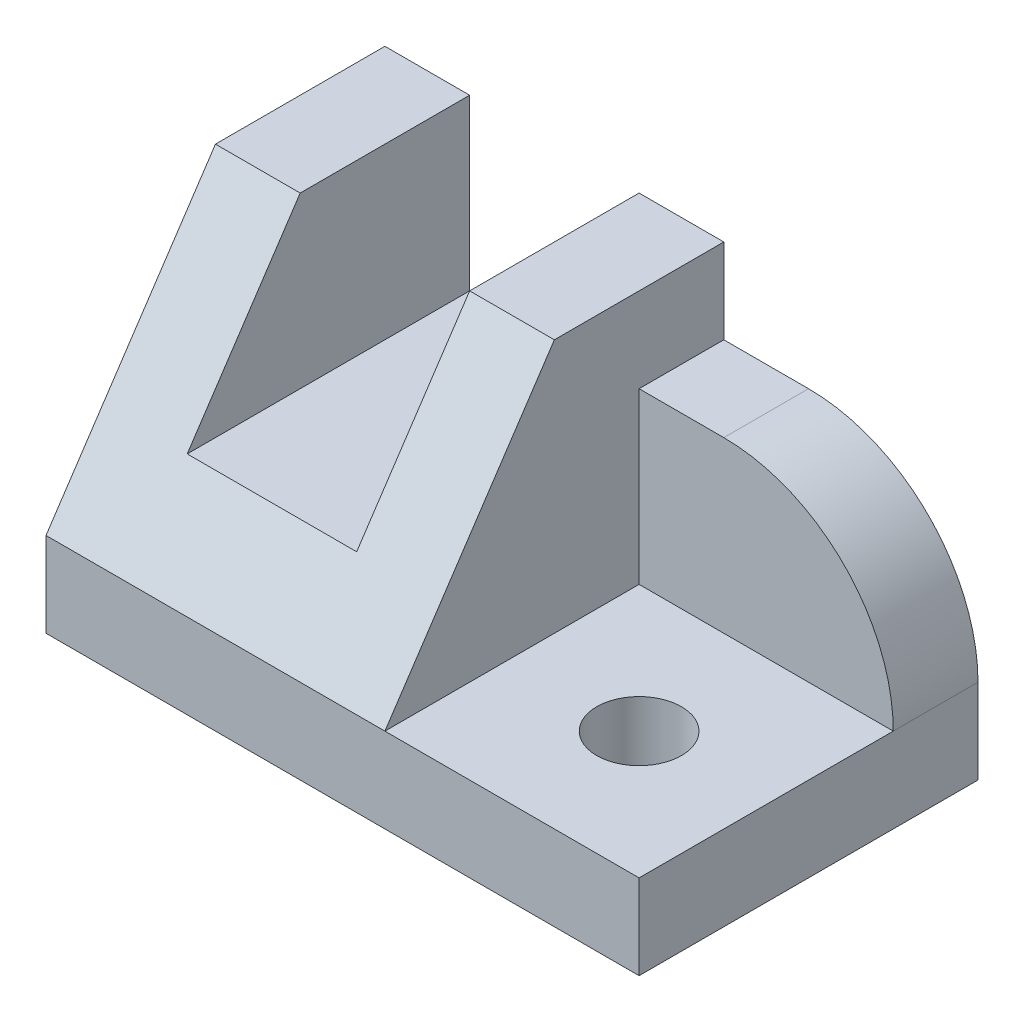
ISO-10303-21;
HEADER;
FILE_DESCRIPTION(('STEP AP214'),'2;1');
FILE_NAME('part.step','',(''),(''),'','','');
FILE_SCHEMA(('AUTOMOTIVE_DESIGN { 1 0 10303 214 1 1 1 1 }'));
ENDSEC;
DATA;
#1=APPLICATION_CONTEXT('core data for automotive mechanical design processes');
#2=APPLICATION_PROTOCOL_DEFINITION('international standard','automotive_design',2000,#1);
#3=PRODUCT_CONTEXT('',#1,'mechanical');
#4=PRODUCT('Part','Part','',(#3));
#5=PRODUCT_RELATED_PRODUCT_CATEGORY('part','',(#4));
#6=PRODUCT_DEFINITION_FORMATION('','',#4);
#7=PRODUCT_DEFINITION_CONTEXT('part definition',#1,'design');
#8=PRODUCT_DEFINITION('design','',#6,#7);
#9=PRODUCT_DEFINITION_SHAPE('','',#8);
#10=(LENGTH_UNIT() NAMED_UNIT(*) SI_UNIT(.MILLI.,.METRE.));
#11=(NAMED_UNIT(*) PLANE_ANGLE_UNIT() SI_UNIT($,.RADIAN.));
#12=(NAMED_UNIT(*) SI_UNIT($,.STERADIAN.) SOLID_ANGLE_UNIT());
#13=UNCERTAINTY_MEASURE_WITH_UNIT(LENGTH_MEASURE(1.E-05),#10,'distance_accuracy_value','');
#14=(GEOMETRIC_REPRESENTATION_CONTEXT(3) GLOBAL_UNCERTAINTY_ASSIGNED_CONTEXT((#13)) GLOBAL_UNIT_ASSIGNED_CONTEXT((#10,
#11,#12)) REPRESENTATION_CONTEXT('',''));
#15=CARTESIAN_POINT('',(0.,0.,0.));
#16=DIRECTION('',(0.,0.,1.));
#17=DIRECTION('',(1.,0.,0.));
#18=AXIS2_PLACEMENT_3D('',#15,#16,#17);
#19=CARTESIAN_POINT('',(0.,20.,0.));
#20=DIRECTION('',(0.,1.,0.));
#21=DIRECTION('',(0.,0.,1.));
#22=AXIS2_PLACEMENT_3D('',#19,#20,#21);
#23=PLANE('',#22);
#24=DIRECTION('',(0.,0.,-1.));
#25=VECTOR('',#24,1.);
#26=CARTESIAN_POINT('',(-2.5,20.,10.));
#27=LINE('',#26,#25);
#28=CARTESIAN_POINT('',(-2.5,20.,0.));
#29=VERTEX_POINT('',#28);
#30=CARTESIAN_POINT('',(-2.5,20.,-10.));
#31=VERTEX_POINT('',#30);
#32=EDGE_CURVE('E150',#29,#31,#27,.T.);
#33=ORIENTED_EDGE('',*,*,#32,.F.);
#34=DIRECTION('',(1.,0.,0.));
#35=VECTOR('',#34,1.);
#36=CARTESIAN_POINT('',(-17.5,20.,0.));
#37=LINE('',#36,#35);
#38=CARTESIAN_POINT('',(2.50000000000001,20.,0.));
#39=VERTEX_POINT('',#38);
#40=EDGE_CURVE('E174',#29,#39,#37,.T.);
#41=ORIENTED_EDGE('',*,*,#40,.T.);
#42=DIRECTION('',(0.,0.,1.));
#43=VECTOR('',#42,1.);
#44=CARTESIAN_POINT('',(2.50000000000001,20.,0.));
#45=LINE('',#44,#43);
#46=CARTESIAN_POINT('',(2.50000000000001,20.,-10.));
#47=VERTEX_POINT('',#46);
#48=EDGE_CURVE('E176',#47,#39,#45,.T.);
#49=ORIENTED_EDGE('',*,*,#48,.F.);
#50=DIRECTION('',(1.,0.,0.));
#51=VECTOR('',#50,1.);
#52=CARTESIAN_POINT('',(0.,20.,-10.));
#53=LINE('',#52,#51);
#54=EDGE_CURVE('E179',#31,#47,#53,.T.);
#55=ORIENTED_EDGE('',*,*,#54,.F.);
#56=EDGE_LOOP('',(#33,#41,#49,#55));
#57=FACE_BOUND('',#56,.T.);
#58=ADVANCED_FACE('F39',(#57),#23,.T.);
#59=CARTESIAN_POINT('',(0.,5.,10.));
#60=DIRECTION('',(0.,0.,-1.));
#61=DIRECTION('',(-1.,0.,0.));
#62=AXIS2_PLACEMENT_3D('',#59,#60,#61);
#63=PLANE('',#62);
#64=DIRECTION('',(1.,0.,0.));
#65=VECTOR('',#64,1.);
#66=CARTESIAN_POINT('',(0.,5.,10.));
#67=LINE('',#66,#65);
#68=CARTESIAN_POINT('',(2.50000000000001,5.,10.));
#69=VERTEX_POINT('',#68);
#70=CARTESIAN_POINT('',(17.5,5.,10.));
#71=VERTEX_POINT('',#70);
#72=EDGE_CURVE('E221',#69,#71,#67,.T.);
#73=ORIENTED_EDGE('',*,*,#72,.F.);
#74=DIRECTION('',(1.,0.,0.));
#75=VECTOR('',#74,1.);
#76=CARTESIAN_POINT('',(-17.5,5.,10.));
#77=LINE('',#76,#75);
#78=CARTESIAN_POINT('',(-17.5,5.,10.));
#79=VERTEX_POINT('',#78);
#80=EDGE_CURVE('E167',#79,#69,#77,.T.);
#81=ORIENTED_EDGE('',*,*,#80,.F.);
#82=DIRECTION('',(0.,-1.,0.));
#83=VECTOR('',#82,1.);
#84=CARTESIAN_POINT('',(-17.5,20.,10.));
#85=LINE('',#84,#83);
#86=CARTESIAN_POINT('',(-17.5,0.,10.));
#87=VERTEX_POINT('',#86);
#88=EDGE_CURVE('E184',#79,#87,#85,.T.);
#89=ORIENTED_EDGE('',*,*,#88,.T.);
#90=DIRECTION('',(1.,0.,0.));
#91=VECTOR('',#90,1.);
#92=CARTESIAN_POINT('',(0.,0.,10.));
#93=LINE('',#92,#91);
#94=CARTESIAN_POINT('',(17.5,0.,10.));
#95=VERTEX_POINT('',#94);
#96=EDGE_CURVE('E230',#87,#95,#93,.T.);
#97=ORIENTED_EDGE('',*,*,#96,.T.);
#98=DIRECTION('',(0.,-1.,0.));
#99=VECTOR('',#98,1.);
#100=CARTESIAN_POINT('',(17.5,5.,10.));
#101=LINE('',#100,#99);
#102=EDGE_CURVE('E227',#71,#95,#101,.T.);
#103=ORIENTED_EDGE('',*,*,#102,.F.);
#104=EDGE_LOOP('',(#73,#81,#89,#97,#103));
#105=FACE_BOUND('',#104,.T.);
#106=ADVANCED_FACE('F270',(#105),#63,.F.);
#107=CARTESIAN_POINT('',(10.,5.,2.5));
#108=DIRECTION('',(0.,-1.,0.));
#109=DIRECTION('',(0.,0.,-1.));
#110=AXIS2_PLACEMENT_3D('',#107,#108,#109);
#111=CYLINDRICAL_SURFACE('',#110,2.5);
#112=CARTESIAN_POINT('',(10.,5.,2.5));
#113=DIRECTION('',(0.,1.,0.));
#114=DIRECTION('',(0.,0.,1.));
#115=AXIS2_PLACEMENT_3D('',#112,#113,#114);
#116=CIRCLE('',#115,2.5);
#117=CARTESIAN_POINT('',(10.,5.,5.));
#118=VERTEX_POINT('',#117);
#119=EDGE_CURVE('E211',#118,#118,#116,.T.);
#120=ORIENTED_EDGE('',*,*,#119,.T.);
#121=EDGE_LOOP('',(#120));
#122=FACE_BOUND('',#121,.T.);
#123=CARTESIAN_POINT('',(10.,0.,2.5));
#124=DIRECTION('',(0.,1.,0.));
#125=DIRECTION('',(0.,0.,1.));
#126=AXIS2_PLACEMENT_3D('',#123,#124,#125);
#127=CIRCLE('',#126,2.5);
#128=CARTESIAN_POINT('',(10.,0.,5.));
#129=VERTEX_POINT('',#128);
#130=EDGE_CURVE('E210',#129,#129,#127,.T.);
#131=ORIENTED_EDGE('',*,*,#130,.F.);
#132=EDGE_LOOP('',(#131));
#133=FACE_BOUND('',#132,.T.);
#134=ADVANCED_FACE('F299',(#122,#133),#111,.F.);
#135=CARTESIAN_POINT('',(17.5,5.,0.));
#136=DIRECTION('',(-1.,0.,0.));
#137=DIRECTION('',(0.,0.,1.));
#138=AXIS2_PLACEMENT_3D('',#135,#136,#137);
#139=PLANE('',#138);
#140=DIRECTION('',(0.,-1.,0.));
#141=VECTOR('',#140,1.);
#142=CARTESIAN_POINT('',(17.5,15.,-10.));
#143=LINE('',#142,#141);
#144=CARTESIAN_POINT('',(17.5,5.,-10.));
#145=VERTEX_POINT('',#144);
#146=CARTESIAN_POINT('',(17.5,0.,-10.));
#147=VERTEX_POINT('',#146);
#148=EDGE_CURVE('E203',#145,#147,#143,.T.);
#149=ORIENTED_EDGE('',*,*,#148,.F.);
#150=DIRECTION('',(0.,0.,-1.));
#151=VECTOR('',#150,1.);
#152=CARTESIAN_POINT('',(17.5,5.,-5.));
#153=LINE('',#152,#151);
#154=CARTESIAN_POINT('',(17.5,5.,-5.));
#155=VERTEX_POINT('',#154);
#156=EDGE_CURVE('E47',#145,#155,#153,.F.);
#157=ORIENTED_EDGE('',*,*,#156,.T.);
#158=DIRECTION('',(0.,0.,-1.));
#159=VECTOR('',#158,1.);
#160=CARTESIAN_POINT('',(17.5,5.,0.));
#161=LINE('',#160,#159);
#162=EDGE_CURVE('E224',#71,#155,#161,.T.);
#163=ORIENTED_EDGE('',*,*,#162,.F.);
#164=ORIENTED_EDGE('',*,*,#102,.T.);
#165=DIRECTION('',(0.,0.,-1.));
#166=VECTOR('',#165,1.);
#167=CARTESIAN_POINT('',(17.5,0.,0.));
#168=LINE('',#167,#166);
#169=EDGE_CURVE('E215',#95,#147,#168,.T.);
#170=ORIENTED_EDGE('',*,*,#169,.T.);
#171=EDGE_LOOP('',(#149,#157,#163,#164,#170));
#172=FACE_BOUND('',#171,.T.);
#173=ADVANCED_FACE('F246',(#172),#139,.F.);
#174=CARTESIAN_POINT('',(0.,5.,0.));
#175=DIRECTION('',(0.,1.,0.));
#176=DIRECTION('',(0.,0.,1.));
#177=AXIS2_PLACEMENT_3D('',#174,#175,#176);
#178=PLANE('',#177);
#179=ORIENTED_EDGE('',*,*,#119,.F.);
#180=EDGE_LOOP('',(#179));
#181=FACE_BOUND('',#180,.T.);
#182=DIRECTION('',(1.,0.,0.));
#183=VECTOR('',#182,1.);
#184=CARTESIAN_POINT('',(0.,5.,-5.));
#185=LINE('',#184,#183);
#186=CARTESIAN_POINT('',(2.50000000000001,5.,-5.));
#187=VERTEX_POINT('',#186);
#188=EDGE_CURVE('E214',#187,#155,#185,.T.);
#189=ORIENTED_EDGE('',*,*,#188,.F.);
#190=DIRECTION('',(0.,0.,1.));
#191=VECTOR('',#190,1.);
#192=CARTESIAN_POINT('',(2.50000000000001,5.,0.));
#193=LINE('',#192,#191);
#194=EDGE_CURVE('E218',#187,#69,#193,.T.);
#195=ORIENTED_EDGE('',*,*,#194,.T.);
#196=ORIENTED_EDGE('',*,*,#72,.T.);
#197=ORIENTED_EDGE('',*,*,#162,.T.);
#198=EDGE_LOOP('',(#189,#195,#196,#197));
#199=FACE_BOUND('',#198,.T.);
#200=ADVANCED_FACE('F250',(#181,#199),#178,.T.);
#201=CARTESIAN_POINT('',(0.,0.,0.));
#202=DIRECTION('',(0.,1.,0.));
#203=DIRECTION('',(0.,0.,1.));
#204=AXIS2_PLACEMENT_3D('',#201,#202,#203);
#205=PLANE('',#204);
#206=ORIENTED_EDGE('',*,*,#130,.T.);
#207=EDGE_LOOP('',(#206));
#208=FACE_BOUND('',#207,.T.);
#209=ORIENTED_EDGE('',*,*,#96,.F.);
#210=DIRECTION('',(0.,0.,-1.));
#211=VECTOR('',#210,1.);
#212=CARTESIAN_POINT('',(-17.5,0.,0.));
#213=LINE('',#212,#211);
#214=CARTESIAN_POINT('',(-17.5,0.,-10.));
#215=VERTEX_POINT('',#214);
#216=EDGE_CURVE('E173',#87,#215,#213,.T.);
#217=ORIENTED_EDGE('',*,*,#216,.T.);
#218=DIRECTION('',(1.,0.,0.));
#219=VECTOR('',#218,1.);
#220=CARTESIAN_POINT('',(0.,0.,-10.));
#221=LINE('',#220,#219);
#222=EDGE_CURVE('E194',#215,#147,#221,.T.);
#223=ORIENTED_EDGE('',*,*,#222,.T.);
#224=ORIENTED_EDGE('',*,*,#169,.F.);
#225=EDGE_LOOP('',(#209,#217,#223,#224));
#226=FACE_BOUND('',#225,.T.);
#227=ADVANCED_FACE('F274',(#208,#226),#205,.F.);
#228=CARTESIAN_POINT('',(0.,15.,-5.));
#229=DIRECTION('',(0.,0.,-1.));
#230=DIRECTION('',(-1.,0.,0.));
#231=AXIS2_PLACEMENT_3D('',#228,#229,#230);
#232=PLANE('',#231);
#233=ORIENTED_EDGE('',*,*,#188,.T.);
#234=CARTESIAN_POINT('',(7.50000000000001,5.,-5.));
#235=DIRECTION('',(0.,0.,-1.));
#236=DIRECTION('',(-1.,0.,0.));
#237=AXIS2_PLACEMENT_3D('',#234,#235,#236);
#238=CIRCLE('',#237,10.);
#239=CARTESIAN_POINT('',(7.50000000000001,15.,-5.));
#240=VERTEX_POINT('',#239);
#241=EDGE_CURVE('E11',#155,#240,#238,.F.);
#242=ORIENTED_EDGE('',*,*,#241,.T.);
#243=DIRECTION('',(1.,0.,0.));
#244=VECTOR('',#243,1.);
#245=CARTESIAN_POINT('',(0.,15.,-5.));
#246=LINE('',#245,#244);
#247=CARTESIAN_POINT('',(2.50000000000001,15.,-5.));
#248=VERTEX_POINT('',#247);
#249=EDGE_CURVE('E198',#248,#240,#246,.T.);
#250=ORIENTED_EDGE('',*,*,#249,.F.);
#251=DIRECTION('',(0.,-1.,0.));
#252=VECTOR('',#251,1.);
#253=CARTESIAN_POINT('',(2.50000000000001,15.,-5.));
#254=LINE('',#253,#252);
#255=EDGE_CURVE('E207',#248,#187,#254,.T.);
#256=ORIENTED_EDGE('',*,*,#255,.T.);
#257=EDGE_LOOP('',(#233,#242,#250,#256));
#258=FACE_BOUND('',#257,.T.);
#259=ADVANCED_FACE('F254',(#258),#232,.F.);
#260=CARTESIAN_POINT('',(0.,15.,-10.));
#261=DIRECTION('',(0.,0.,-1.));
#262=DIRECTION('',(-1.,0.,0.));
#263=AXIS2_PLACEMENT_3D('',#260,#261,#262);
#264=PLANE('',#263);
#265=DIRECTION('',(1.,0.,0.));
#266=VECTOR('',#265,1.);
#267=CARTESIAN_POINT('',(0.,15.,-10.));
#268=LINE('',#267,#266);
#269=CARTESIAN_POINT('',(2.50000000000001,15.,-10.));
#270=VERTEX_POINT('',#269);
#271=CARTESIAN_POINT('',(7.50000000000001,15.,-10.));
#272=VERTEX_POINT('',#271);
#273=EDGE_CURVE('E201',#270,#272,#268,.T.);
#274=ORIENTED_EDGE('',*,*,#273,.T.);
#275=CARTESIAN_POINT('',(7.50000000000001,5.,-10.));
#276=DIRECTION('',(0.,0.,-1.));
#277=DIRECTION('',(-1.,0.,0.));
#278=AXIS2_PLACEMENT_3D('',#275,#276,#277);
#279=CIRCLE('',#278,10.);
#280=EDGE_CURVE('E54',#272,#145,#279,.T.);
#281=ORIENTED_EDGE('',*,*,#280,.T.);
#282=ORIENTED_EDGE('',*,*,#148,.T.);
#283=ORIENTED_EDGE('',*,*,#222,.F.);
#284=DIRECTION('',(0.,-1.,0.));
#285=VECTOR('',#284,1.);
#286=CARTESIAN_POINT('',(-17.5,20.,-10.));
#287=LINE('',#286,#285);
#288=CARTESIAN_POINT('',(-17.5,20.,-10.));
#289=VERTEX_POINT('',#288);
#290=EDGE_CURVE('E188',#289,#215,#287,.T.);
#291=ORIENTED_EDGE('',*,*,#290,.F.);
#292=CARTESIAN_POINT('',(-12.5,20.,-10.));
#293=VERTEX_POINT('',#292);
#294=EDGE_CURVE('E180',#289,#293,#53,.T.);
#295=ORIENTED_EDGE('',*,*,#294,.T.);
#296=DIRECTION('',(0.,1.,0.));
#297=VECTOR('',#296,1.);
#298=CARTESIAN_POINT('',(-12.5,20.,-10.));
#299=LINE('',#298,#297);
#300=CARTESIAN_POINT('',(-12.5,10.,-10.));
#301=VERTEX_POINT('',#300);
#302=EDGE_CURVE('E144',#301,#293,#299,.T.);
#303=ORIENTED_EDGE('',*,*,#302,.F.);
#304=DIRECTION('',(-1.,0.,0.));
#305=VECTOR('',#304,1.);
#306=CARTESIAN_POINT('',(-2.5,10.,-10.));
#307=LINE('',#306,#305);
#308=CARTESIAN_POINT('',(-2.5,10.,-10.));
#309=VERTEX_POINT('',#308);
#310=EDGE_CURVE('E137',#309,#301,#307,.T.);
#311=ORIENTED_EDGE('',*,*,#310,.F.);
#312=DIRECTION('',(0.,-1.,0.));
#313=VECTOR('',#312,1.);
#314=CARTESIAN_POINT('',(-2.5,20.,-10.));
#315=LINE('',#314,#313);
#316=EDGE_CURVE('E147',#31,#309,#315,.T.);
#317=ORIENTED_EDGE('',*,*,#316,.F.);
#318=ORIENTED_EDGE('',*,*,#54,.T.);
#319=DIRECTION('',(0.,-1.,0.));
#320=VECTOR('',#319,1.);
#321=CARTESIAN_POINT('',(2.50000000000001,20.,-10.));
#322=LINE('',#321,#320);
#323=EDGE_CURVE('E191',#47,#270,#322,.T.);
#324=ORIENTED_EDGE('',*,*,#323,.T.);
#325=EDGE_LOOP('',(#274,#281,#282,#283,#291,#295,#303,#311,#317,#318,#324));
#326=FACE_BOUND('',#325,.T.);
#327=ADVANCED_FACE('F153',(#326),#264,.T.);
#328=CARTESIAN_POINT('',(0.,15.,0.));
#329=DIRECTION('',(0.,1.,0.));
#330=DIRECTION('',(0.,0.,1.));
#331=AXIS2_PLACEMENT_3D('',#328,#329,#330);
#332=PLANE('',#331);
#333=ORIENTED_EDGE('',*,*,#249,.T.);
#334=DIRECTION('',(0.,0.,-1.));
#335=VECTOR('',#334,1.);
#336=CARTESIAN_POINT('',(7.50000000000001,15.,-10.));
#337=LINE('',#336,#335);
#338=EDGE_CURVE('E243',#240,#272,#337,.T.);
#339=ORIENTED_EDGE('',*,*,#338,.T.);
#340=ORIENTED_EDGE('',*,*,#273,.F.);
#341=DIRECTION('',(0.,0.,1.));
#342=VECTOR('',#341,1.);
#343=CARTESIAN_POINT('',(2.50000000000001,15.,0.));
#344=LINE('',#343,#342);
#345=EDGE_CURVE('E195',#270,#248,#344,.T.);
#346=ORIENTED_EDGE('',*,*,#345,.T.);
#347=EDGE_LOOP('',(#333,#339,#340,#346));
#348=FACE_BOUND('',#347,.T.);
#349=ADVANCED_FACE('F258',(#348),#332,.T.);
#350=CARTESIAN_POINT('',(2.50000000000001,20.,0.));
#351=DIRECTION('',(1.,0.,0.));
#352=DIRECTION('',(0.,0.,-1.));
#353=AXIS2_PLACEMENT_3D('',#350,#351,#352);
#354=PLANE('',#353);
#355=DIRECTION('',(0.,0.832050294337844,-0.554700196225229));
#356=VECTOR('',#355,1.);
#357=CARTESIAN_POINT('',(2.50000000000001,5.,10.));
#358=LINE('',#357,#356);
#359=EDGE_CURVE('E159',#69,#39,#358,.T.);
#360=ORIENTED_EDGE('',*,*,#359,.F.);
#361=ORIENTED_EDGE('',*,*,#194,.F.);
#362=ORIENTED_EDGE('',*,*,#255,.F.);
#363=ORIENTED_EDGE('',*,*,#345,.F.);
#364=ORIENTED_EDGE('',*,*,#323,.F.);
#365=ORIENTED_EDGE('',*,*,#48,.T.);
#366=EDGE_LOOP('',(#360,#361,#362,#363,#364,#365));
#367=FACE_BOUND('',#366,.T.);
#368=ADVANCED_FACE('F263',(#367),#354,.T.);
#369=CARTESIAN_POINT('',(-17.5,20.,0.));
#370=DIRECTION('',(-1.,0.,0.));
#371=DIRECTION('',(0.,0.,1.));
#372=AXIS2_PLACEMENT_3D('',#369,#370,#371);
#373=PLANE('',#372);
#374=DIRECTION('',(0.,0.832050294337844,-0.554700196225229));
#375=VECTOR('',#374,1.);
#376=CARTESIAN_POINT('',(-17.5,5.,10.));
#377=LINE('',#376,#375);
#378=CARTESIAN_POINT('',(-17.5,20.,0.));
#379=VERTEX_POINT('',#378);
#380=EDGE_CURVE('E164',#79,#379,#377,.T.);
#381=ORIENTED_EDGE('',*,*,#380,.T.);
#382=DIRECTION('',(0.,0.,-1.));
#383=VECTOR('',#382,1.);
#384=CARTESIAN_POINT('',(-17.5,20.,0.));
#385=LINE('',#384,#383);
#386=EDGE_CURVE('E182',#379,#289,#385,.T.);
#387=ORIENTED_EDGE('',*,*,#386,.T.);
#388=ORIENTED_EDGE('',*,*,#290,.T.);
#389=ORIENTED_EDGE('',*,*,#216,.F.);
#390=ORIENTED_EDGE('',*,*,#88,.F.);
#391=EDGE_LOOP('',(#381,#387,#388,#389,#390));
#392=FACE_BOUND('',#391,.T.);
#393=ADVANCED_FACE('F279',(#392),#373,.T.);
#394=DIRECTION('',(0.,0.,-1.));
#395=VECTOR('',#394,1.);
#396=CARTESIAN_POINT('',(-12.5,20.,10.));
#397=LINE('',#396,#395);
#398=CARTESIAN_POINT('',(-12.5,20.,0.));
#399=VERTEX_POINT('',#398);
#400=EDGE_CURVE('E160',#399,#293,#397,.T.);
#401=ORIENTED_EDGE('',*,*,#400,.T.);
#402=ORIENTED_EDGE('',*,*,#294,.F.);
#403=ORIENTED_EDGE('',*,*,#386,.F.);
#404=EDGE_CURVE('E170',#379,#399,#37,.T.);
#405=ORIENTED_EDGE('',*,*,#404,.T.);
#406=EDGE_LOOP('',(#401,#402,#403,#405));
#407=FACE_BOUND('',#406,.T.);
#408=ADVANCED_FACE('F282',(#407),#23,.T.);
#409=CARTESIAN_POINT('',(-17.5,5.,10.));
#410=DIRECTION('',(0.,-0.554700196225229,-0.832050294337844));
#411=DIRECTION('',(0.,0.832050294337844,-0.554700196225229));
#412=AXIS2_PLACEMENT_3D('',#409,#410,#411);
#413=PLANE('',#412);
#414=ORIENTED_EDGE('',*,*,#40,.F.);
#415=DIRECTION('',(0.,-0.832050294337844,0.554700196225229));
#416=VECTOR('',#415,1.);
#417=CARTESIAN_POINT('',(-2.5,5.,10.));
#418=LINE('',#417,#416);
#419=CARTESIAN_POINT('',(-2.5,10.,6.66666666666667));
#420=VERTEX_POINT('',#419);
#421=EDGE_CURVE('E241',#29,#420,#418,.T.);
#422=ORIENTED_EDGE('',*,*,#421,.T.);
#423=DIRECTION('',(-1.,0.,0.));
#424=VECTOR('',#423,1.);
#425=CARTESIAN_POINT('',(-17.5,10.,6.66666666666667));
#426=LINE('',#425,#424);
#427=CARTESIAN_POINT('',(-12.5,10.,6.66666666666667));
#428=VERTEX_POINT('',#427);
#429=EDGE_CURVE('E140',#420,#428,#426,.T.);
#430=ORIENTED_EDGE('',*,*,#429,.T.);
#431=DIRECTION('',(0.,0.832050294337844,-0.554700196225229));
#432=VECTOR('',#431,1.);
#433=CARTESIAN_POINT('',(-12.5,5.,10.));
#434=LINE('',#433,#432);
#435=EDGE_CURVE('E238',#428,#399,#434,.T.);
#436=ORIENTED_EDGE('',*,*,#435,.T.);
#437=ORIENTED_EDGE('',*,*,#404,.F.);
#438=ORIENTED_EDGE('',*,*,#380,.F.);
#439=ORIENTED_EDGE('',*,*,#80,.T.);
#440=ORIENTED_EDGE('',*,*,#359,.T.);
#441=EDGE_LOOP('',(#414,#422,#430,#436,#437,#438,#439,#440));
#442=FACE_BOUND('',#441,.T.);
#443=ADVANCED_FACE('F267',(#442),#413,.F.);
#444=CARTESIAN_POINT('',(-2.5,20.,10.));
#445=DIRECTION('',(1.,0.,0.));
#446=DIRECTION('',(0.,1.,0.));
#447=AXIS2_PLACEMENT_3D('',#444,#445,#446);
#448=PLANE('',#447);
#449=ORIENTED_EDGE('',*,*,#32,.T.);
#450=ORIENTED_EDGE('',*,*,#316,.T.);
#451=DIRECTION('',(0.,0.,-1.));
#452=VECTOR('',#451,1.);
#453=CARTESIAN_POINT('',(-2.5,10.,10.));
#454=LINE('',#453,#452);
#455=EDGE_CURVE('E133',#420,#309,#454,.T.);
#456=ORIENTED_EDGE('',*,*,#455,.F.);
#457=ORIENTED_EDGE('',*,*,#421,.F.);
#458=EDGE_LOOP('',(#449,#450,#456,#457));
#459=FACE_BOUND('',#458,.T.);
#460=ADVANCED_FACE('F148',(#459),#448,.F.);
#461=CARTESIAN_POINT('',(-12.5,20.,10.));
#462=DIRECTION('',(-1.,0.,0.));
#463=DIRECTION('',(0.,-1.,0.));
#464=AXIS2_PLACEMENT_3D('',#461,#462,#463);
#465=PLANE('',#464);
#466=DIRECTION('',(0.,0.,-1.));
#467=VECTOR('',#466,1.);
#468=CARTESIAN_POINT('',(-12.5,10.,10.));
#469=LINE('',#468,#467);
#470=EDGE_CURVE('E143',#428,#301,#469,.T.);
#471=ORIENTED_EDGE('',*,*,#470,.T.);
#472=ORIENTED_EDGE('',*,*,#302,.T.);
#473=ORIENTED_EDGE('',*,*,#400,.F.);
#474=ORIENTED_EDGE('',*,*,#435,.F.);
#475=EDGE_LOOP('',(#471,#472,#473,#474));
#476=FACE_BOUND('',#475,.T.);
#477=ADVANCED_FACE('F285',(#476),#465,.F.);
#478=CARTESIAN_POINT('',(-2.5,10.,10.));
#479=DIRECTION('',(0.,-1.,0.));
#480=DIRECTION('',(0.,0.,-1.));
#481=AXIS2_PLACEMENT_3D('',#478,#479,#480);
#482=PLANE('',#481);
#483=ORIENTED_EDGE('',*,*,#455,.T.);
#484=ORIENTED_EDGE('',*,*,#310,.T.);
#485=ORIENTED_EDGE('',*,*,#470,.F.);
#486=ORIENTED_EDGE('',*,*,#429,.F.);
#487=EDGE_LOOP('',(#483,#484,#485,#486));
#488=FACE_BOUND('',#487,.T.);
#489=ADVANCED_FACE('F135',(#488),#482,.F.);
#490=CARTESIAN_POINT('',(7.50000000000001,5.,0.));
#491=DIRECTION('',(0.,0.,1.));
#492=DIRECTION('',(1.,0.,0.));
#493=AXIS2_PLACEMENT_3D('',#490,#491,#492);
#494=CYLINDRICAL_SURFACE('',#493,10.);
#495=ORIENTED_EDGE('',*,*,#241,.F.);
#496=ORIENTED_EDGE('',*,*,#156,.F.);
#497=ORIENTED_EDGE('',*,*,#280,.F.);
#498=ORIENTED_EDGE('',*,*,#338,.F.);
#499=EDGE_LOOP('',(#495,#496,#497,#498));
#500=FACE_BOUND('',#499,.T.);
#501=ADVANCED_FACE('F41',(#500),#494,.T.);
#502=CLOSED_SHELL('',(#58,#106,#134,#173,#200,#227,#259,#327,#349,#368,#393,#408,#443,#460,#477,
#489,#501));
#503=MANIFOLD_SOLID_BREP('B2',#502);
#504=ADVANCED_BREP_SHAPE_REPRESENTATION('',(#18,#503),#14);
#505=SHAPE_DEFINITION_REPRESENTATION(#9,#504);
ENDSEC;
END-ISO-10303-21;
